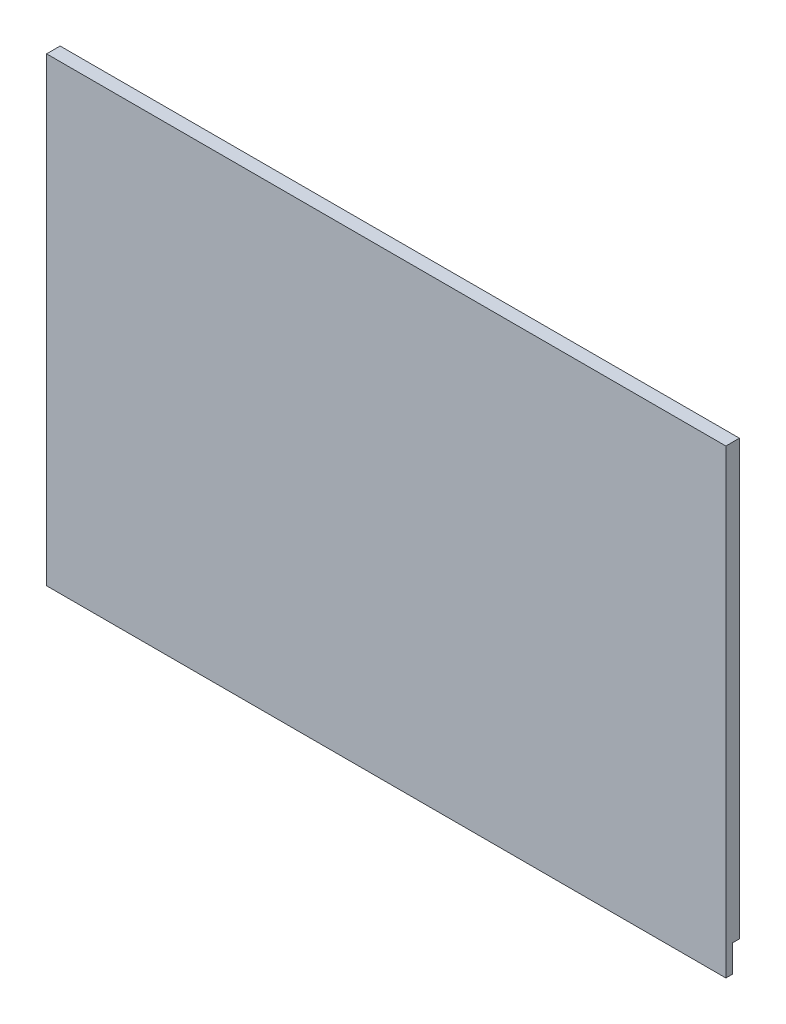
ISO-10303-21;
HEADER;
FILE_DESCRIPTION(('STEP AP214'),'2;1');
FILE_NAME('part.step','',(''),(''),'','','');
FILE_SCHEMA(('AUTOMOTIVE_DESIGN { 1 0 10303 214 1 1 1 1 }'));
ENDSEC;
DATA;
#1=APPLICATION_CONTEXT('core data for automotive mechanical design processes');
#2=APPLICATION_PROTOCOL_DEFINITION('international standard','automotive_design',2000,#1);
#3=PRODUCT_CONTEXT('',#1,'mechanical');
#4=PRODUCT('Part','Part','',(#3));
#5=PRODUCT_RELATED_PRODUCT_CATEGORY('part','',(#4));
#6=PRODUCT_DEFINITION_FORMATION('','',#4);
#7=PRODUCT_DEFINITION_CONTEXT('part definition',#1,'design');
#8=PRODUCT_DEFINITION('design','',#6,#7);
#9=PRODUCT_DEFINITION_SHAPE('','',#8);
#10=(LENGTH_UNIT() NAMED_UNIT(*) SI_UNIT(.MILLI.,.METRE.));
#11=(NAMED_UNIT(*) PLANE_ANGLE_UNIT() SI_UNIT($,.RADIAN.));
#12=(NAMED_UNIT(*) SI_UNIT($,.STERADIAN.) SOLID_ANGLE_UNIT());
#13=UNCERTAINTY_MEASURE_WITH_UNIT(LENGTH_MEASURE(1.E-05),#10,'distance_accuracy_value','');
#14=(GEOMETRIC_REPRESENTATION_CONTEXT(3) GLOBAL_UNCERTAINTY_ASSIGNED_CONTEXT((#13)) GLOBAL_UNIT_ASSIGNED_CONTEXT((#10,
#11,#12)) REPRESENTATION_CONTEXT('',''));
#15=CARTESIAN_POINT('',(0.,0.,0.));
#16=DIRECTION('',(0.,0.,1.));
#17=DIRECTION('',(1.,0.,0.));
#18=AXIS2_PLACEMENT_3D('',#15,#16,#17);
#19=CARTESIAN_POINT('',(0.,0.,3.175));
#20=DIRECTION('',(-1.,0.,0.));
#21=DIRECTION('',(0.,0.,1.));
#22=AXIS2_PLACEMENT_3D('',#19,#20,#21);
#23=PLANE('',#22);
#24=DIRECTION('',(0.,-1.,0.));
#25=VECTOR('',#24,1.);
#26=CARTESIAN_POINT('',(0.,0.,1.5875));
#27=LINE('',#26,#25);
#28=CARTESIAN_POINT('',(0.,6.35,1.5875));
#29=VERTEX_POINT('',#28);
#30=CARTESIAN_POINT('',(0.,0.,1.5875));
#31=VERTEX_POINT('',#30);
#32=EDGE_CURVE('E104',#29,#31,#27,.T.);
#33=ORIENTED_EDGE('',*,*,#32,.F.);
#34=DIRECTION('',(0.,0.,-1.));
#35=VECTOR('',#34,1.);
#36=CARTESIAN_POINT('',(0.,6.35,1.5875));
#37=LINE('',#36,#35);
#38=CARTESIAN_POINT('',(0.,6.35,0.));
#39=VERTEX_POINT('',#38);
#40=EDGE_CURVE('E153',#29,#39,#37,.T.);
#41=ORIENTED_EDGE('',*,*,#40,.T.);
#42=DIRECTION('',(0.,1.,0.));
#43=VECTOR('',#42,1.);
#44=CARTESIAN_POINT('',(0.,0.,0.));
#45=LINE('',#44,#43);
#46=CARTESIAN_POINT('',(0.,107.95,0.));
#47=VERTEX_POINT('',#46);
#48=EDGE_CURVE('E151',#39,#47,#45,.T.);
#49=ORIENTED_EDGE('',*,*,#48,.T.);
#50=DIRECTION('',(0.,0.,-1.));
#51=VECTOR('',#50,1.);
#52=CARTESIAN_POINT('',(0.,107.95,3.175));
#53=LINE('',#52,#51);
#54=CARTESIAN_POINT('',(0.,107.95,3.175));
#55=VERTEX_POINT('',#54);
#56=EDGE_CURVE('E11',#55,#47,#53,.T.);
#57=ORIENTED_EDGE('',*,*,#56,.F.);
#58=DIRECTION('',(0.,1.,0.));
#59=VECTOR('',#58,1.);
#60=CARTESIAN_POINT('',(0.,0.,3.175));
#61=LINE('',#60,#59);
#62=CARTESIAN_POINT('',(0.,0.,3.175));
#63=VERTEX_POINT('',#62);
#64=EDGE_CURVE('E127',#63,#55,#61,.T.);
#65=ORIENTED_EDGE('',*,*,#64,.F.);
#66=DIRECTION('',(0.,0.,-1.));
#67=VECTOR('',#66,1.);
#68=CARTESIAN_POINT('',(0.,0.,3.175));
#69=LINE('',#68,#67);
#70=EDGE_CURVE('E119',#63,#31,#69,.T.);
#71=ORIENTED_EDGE('',*,*,#70,.T.);
#72=EDGE_LOOP('',(#33,#41,#49,#57,#65,#71));
#73=FACE_BOUND('',#72,.T.);
#74=ADVANCED_FACE('F43',(#73),#23,.F.);
#75=CARTESIAN_POINT('',(0.,107.95,3.175));
#76=DIRECTION('',(0.,-1.,0.));
#77=DIRECTION('',(1.,0.,0.));
#78=AXIS2_PLACEMENT_3D('',#75,#76,#77);
#79=PLANE('',#78);
#80=DIRECTION('',(-1.,0.,0.));
#81=VECTOR('',#80,1.);
#82=CARTESIAN_POINT('',(0.,107.95,0.));
#83=LINE('',#82,#81);
#84=CARTESIAN_POINT('',(-159.1564,107.95,0.));
#85=VERTEX_POINT('',#84);
#86=EDGE_CURVE('E82',#47,#85,#83,.T.);
#87=ORIENTED_EDGE('',*,*,#86,.T.);
#88=DIRECTION('',(0.,0.,-1.));
#89=VECTOR('',#88,1.);
#90=CARTESIAN_POINT('',(-159.1564,107.95,3.175));
#91=LINE('',#90,#89);
#92=CARTESIAN_POINT('',(-159.1564,107.95,3.175));
#93=VERTEX_POINT('',#92);
#94=EDGE_CURVE('E51',#93,#85,#91,.T.);
#95=ORIENTED_EDGE('',*,*,#94,.F.);
#96=DIRECTION('',(-1.,0.,0.));
#97=VECTOR('',#96,1.);
#98=CARTESIAN_POINT('',(0.,107.95,3.175));
#99=LINE('',#98,#97);
#100=EDGE_CURVE('E87',#55,#93,#99,.T.);
#101=ORIENTED_EDGE('',*,*,#100,.F.);
#102=ORIENTED_EDGE('',*,*,#56,.T.);
#103=EDGE_LOOP('',(#87,#95,#101,#102));
#104=FACE_BOUND('',#103,.T.);
#105=ADVANCED_FACE('F170',(#104),#79,.F.);
#106=CARTESIAN_POINT('',(-159.1564,0.,3.175));
#107=DIRECTION('',(1.,0.,0.));
#108=DIRECTION('',(0.,0.,-1.));
#109=AXIS2_PLACEMENT_3D('',#106,#107,#108);
#110=PLANE('',#109);
#111=DIRECTION('',(0.,-1.,0.));
#112=VECTOR('',#111,1.);
#113=CARTESIAN_POINT('',(-159.1564,0.,0.));
#114=LINE('',#113,#112);
#115=CARTESIAN_POINT('',(-159.1564,6.34999999999999,0.));
#116=VERTEX_POINT('',#115);
#117=EDGE_CURVE('E136',#85,#116,#114,.T.);
#118=ORIENTED_EDGE('',*,*,#117,.T.);
#119=DIRECTION('',(0.,0.,-1.));
#120=VECTOR('',#119,1.);
#121=CARTESIAN_POINT('',(-159.1564,6.34999999999999,1.5875));
#122=LINE('',#121,#120);
#123=CARTESIAN_POINT('',(-159.1564,6.34999999999999,1.5875));
#124=VERTEX_POINT('',#123);
#125=EDGE_CURVE('E58',#124,#116,#122,.T.);
#126=ORIENTED_EDGE('',*,*,#125,.F.);
#127=DIRECTION('',(0.,1.,0.));
#128=VECTOR('',#127,1.);
#129=CARTESIAN_POINT('',(-159.1564,0.,1.5875));
#130=LINE('',#129,#128);
#131=CARTESIAN_POINT('',(-159.1564,0.,1.5875));
#132=VERTEX_POINT('',#131);
#133=EDGE_CURVE('E124',#132,#124,#130,.T.);
#134=ORIENTED_EDGE('',*,*,#133,.F.);
#135=DIRECTION('',(0.,0.,-1.));
#136=VECTOR('',#135,1.);
#137=CARTESIAN_POINT('',(-159.1564,0.,3.175));
#138=LINE('',#137,#136);
#139=CARTESIAN_POINT('',(-159.1564,0.,3.175));
#140=VERTEX_POINT('',#139);
#141=EDGE_CURVE('E122',#140,#132,#138,.T.);
#142=ORIENTED_EDGE('',*,*,#141,.F.);
#143=DIRECTION('',(0.,-1.,0.));
#144=VECTOR('',#143,1.);
#145=CARTESIAN_POINT('',(-159.1564,0.,3.175));
#146=LINE('',#145,#144);
#147=EDGE_CURVE('E133',#93,#140,#146,.T.);
#148=ORIENTED_EDGE('',*,*,#147,.F.);
#149=ORIENTED_EDGE('',*,*,#94,.T.);
#150=EDGE_LOOP('',(#118,#126,#134,#142,#148,#149));
#151=FACE_BOUND('',#150,.T.);
#152=ADVANCED_FACE('F143',(#151),#110,.F.);
#153=CARTESIAN_POINT('',(0.,0.,3.175));
#154=DIRECTION('',(0.,1.,0.));
#155=DIRECTION('',(-1.,0.,0.));
#156=AXIS2_PLACEMENT_3D('',#153,#154,#155);
#157=PLANE('',#156);
#158=ORIENTED_EDGE('',*,*,#141,.T.);
#159=DIRECTION('',(-1.,0.,0.));
#160=VECTOR('',#159,1.);
#161=CARTESIAN_POINT('',(0.,0.,1.5875));
#162=LINE('',#161,#160);
#163=EDGE_CURVE('E107',#31,#132,#162,.T.);
#164=ORIENTED_EDGE('',*,*,#163,.F.);
#165=ORIENTED_EDGE('',*,*,#70,.F.);
#166=DIRECTION('',(1.,0.,0.));
#167=VECTOR('',#166,1.);
#168=CARTESIAN_POINT('',(0.,0.,3.175));
#169=LINE('',#168,#167);
#170=EDGE_CURVE('E67',#140,#63,#169,.T.);
#171=ORIENTED_EDGE('',*,*,#170,.F.);
#172=EDGE_LOOP('',(#158,#164,#165,#171));
#173=FACE_BOUND('',#172,.T.);
#174=ADVANCED_FACE('F118',(#173),#157,.F.);
#175=CARTESIAN_POINT('',(0.,0.,3.175));
#176=DIRECTION('',(0.,0.,1.));
#177=DIRECTION('',(1.,0.,0.));
#178=AXIS2_PLACEMENT_3D('',#175,#176,#177);
#179=PLANE('',#178);
#180=ORIENTED_EDGE('',*,*,#64,.T.);
#181=ORIENTED_EDGE('',*,*,#100,.T.);
#182=ORIENTED_EDGE('',*,*,#147,.T.);
#183=ORIENTED_EDGE('',*,*,#170,.T.);
#184=EDGE_LOOP('',(#180,#181,#182,#183));
#185=FACE_BOUND('',#184,.T.);
#186=ADVANCED_FACE('F180',(#185),#179,.T.);
#187=CARTESIAN_POINT('',(0.,0.,0.));
#188=DIRECTION('',(0.,0.,1.));
#189=DIRECTION('',(1.,0.,0.));
#190=AXIS2_PLACEMENT_3D('',#187,#188,#189);
#191=PLANE('',#190);
#192=ORIENTED_EDGE('',*,*,#48,.F.);
#193=DIRECTION('',(1.,0.,0.));
#194=VECTOR('',#193,1.);
#195=CARTESIAN_POINT('',(0.,6.35,0.));
#196=LINE('',#195,#194);
#197=EDGE_CURVE('E114',#116,#39,#196,.T.);
#198=ORIENTED_EDGE('',*,*,#197,.F.);
#199=ORIENTED_EDGE('',*,*,#117,.F.);
#200=ORIENTED_EDGE('',*,*,#86,.F.);
#201=EDGE_LOOP('',(#192,#198,#199,#200));
#202=FACE_BOUND('',#201,.T.);
#203=ADVANCED_FACE('F146',(#202),#191,.F.);
#204=CARTESIAN_POINT('',(0.,6.35,1.5875));
#205=DIRECTION('',(0.,1.,0.));
#206=DIRECTION('',(-1.,0.,0.));
#207=AXIS2_PLACEMENT_3D('',#204,#205,#206);
#208=PLANE('',#207);
#209=ORIENTED_EDGE('',*,*,#197,.T.);
#210=ORIENTED_EDGE('',*,*,#40,.F.);
#211=DIRECTION('',(1.,0.,0.));
#212=VECTOR('',#211,1.);
#213=CARTESIAN_POINT('',(0.,6.35,1.5875));
#214=LINE('',#213,#212);
#215=EDGE_CURVE('E109',#124,#29,#214,.T.);
#216=ORIENTED_EDGE('',*,*,#215,.F.);
#217=ORIENTED_EDGE('',*,*,#125,.T.);
#218=EDGE_LOOP('',(#209,#210,#216,#217));
#219=FACE_BOUND('',#218,.T.);
#220=ADVANCED_FACE('F169',(#219),#208,.F.);
#221=CARTESIAN_POINT('',(0.,0.,1.5875));
#222=DIRECTION('',(0.,0.,1.));
#223=DIRECTION('',(1.,0.,0.));
#224=AXIS2_PLACEMENT_3D('',#221,#222,#223);
#225=PLANE('',#224);
#226=ORIENTED_EDGE('',*,*,#32,.T.);
#227=ORIENTED_EDGE('',*,*,#163,.T.);
#228=ORIENTED_EDGE('',*,*,#133,.T.);
#229=ORIENTED_EDGE('',*,*,#215,.T.);
#230=EDGE_LOOP('',(#226,#227,#228,#229));
#231=FACE_BOUND('',#230,.T.);
#232=ADVANCED_FACE('F106',(#231),#225,.F.);
#233=CLOSED_SHELL('',(#74,#105,#152,#174,#186,#203,#220,#232));
#234=MANIFOLD_SOLID_BREP('B2',#233);
#235=ADVANCED_BREP_SHAPE_REPRESENTATION('',(#18,#234),#14);
#236=SHAPE_DEFINITION_REPRESENTATION(#9,#235);
ENDSEC;
END-ISO-10303-21;
